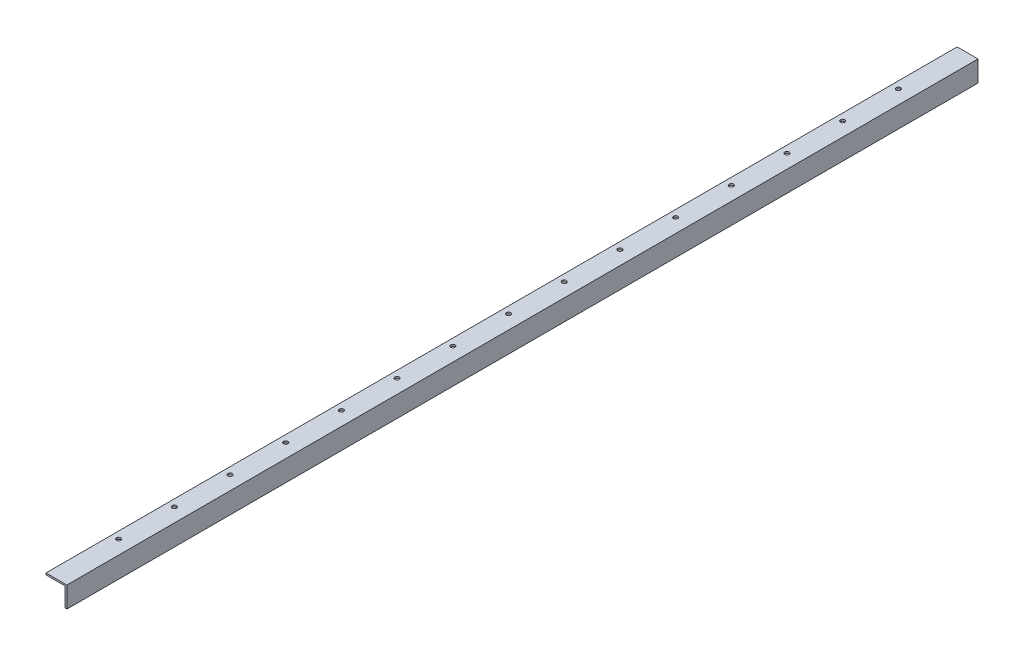
ISO-10303-21;
HEADER;
FILE_DESCRIPTION(('STEP AP214'),'2;1');
FILE_NAME('part.step','',(''),(''),'','','');
FILE_SCHEMA(('AUTOMOTIVE_DESIGN { 1 0 10303 214 1 1 1 1 }'));
ENDSEC;
DATA;
#1=APPLICATION_CONTEXT('core data for automotive mechanical design processes');
#2=APPLICATION_PROTOCOL_DEFINITION('international standard','automotive_design',2000,#1);
#3=PRODUCT_CONTEXT('',#1,'mechanical');
#4=PRODUCT('Part','Part','',(#3));
#5=PRODUCT_RELATED_PRODUCT_CATEGORY('part','',(#4));
#6=PRODUCT_DEFINITION_FORMATION('','',#4);
#7=PRODUCT_DEFINITION_CONTEXT('part definition',#1,'design');
#8=PRODUCT_DEFINITION('design','',#6,#7);
#9=PRODUCT_DEFINITION_SHAPE('','',#8);
#10=(LENGTH_UNIT() NAMED_UNIT(*) SI_UNIT(.MILLI.,.METRE.));
#11=(NAMED_UNIT(*) PLANE_ANGLE_UNIT() SI_UNIT($,.RADIAN.));
#12=(NAMED_UNIT(*) SI_UNIT($,.STERADIAN.) SOLID_ANGLE_UNIT());
#13=UNCERTAINTY_MEASURE_WITH_UNIT(LENGTH_MEASURE(1.E-05),#10,'distance_accuracy_value','');
#14=(GEOMETRIC_REPRESENTATION_CONTEXT(3) GLOBAL_UNCERTAINTY_ASSIGNED_CONTEXT((#13)) GLOBAL_UNIT_ASSIGNED_CONTEXT((#10,
#11,#12)) REPRESENTATION_CONTEXT('',''));
#15=CARTESIAN_POINT('',(0.,0.,0.));
#16=DIRECTION('',(0.,0.,1.));
#17=DIRECTION('',(1.,0.,0.));
#18=AXIS2_PLACEMENT_3D('',#15,#16,#17);
#19=CARTESIAN_POINT('',(-25.4,-41.275,1542.25625));
#20=DIRECTION('',(0.,1.,0.));
#21=DIRECTION('',(0.,0.,1.));
#22=AXIS2_PLACEMENT_3D('',#19,#20,#21);
#23=CYLINDRICAL_SURFACE('',#22,3.96874999999999);
#24=CARTESIAN_POINT('',(-25.4,-3.175,1542.25625));
#25=DIRECTION('',(0.,1.,0.));
#26=DIRECTION('',(0.,0.,1.));
#27=AXIS2_PLACEMENT_3D('',#24,#25,#26);
#28=CIRCLE('',#27,3.96874999999999);
#29=CARTESIAN_POINT('',(-25.4,-3.175,1546.225));
#30=VERTEX_POINT('',#29);
#31=EDGE_CURVE('E45',#30,#30,#28,.T.);
#32=ORIENTED_EDGE('',*,*,#31,.F.);
#33=EDGE_LOOP('',(#32));
#34=FACE_BOUND('',#33,.T.);
#35=CARTESIAN_POINT('',(-25.4,0.,1542.25625));
#36=DIRECTION('',(0.,-1.,0.));
#37=DIRECTION('',(1.,0.,0.));
#38=AXIS2_PLACEMENT_3D('',#35,#36,#37);
#39=CIRCLE('',#38,3.96874999999999);
#40=CARTESIAN_POINT('',(-21.43125,0.,1542.25625));
#41=VERTEX_POINT('',#40);
#42=EDGE_CURVE('E11',#41,#41,#39,.T.);
#43=ORIENTED_EDGE('',*,*,#42,.F.);
#44=EDGE_LOOP('',(#43));
#45=FACE_BOUND('',#44,.T.);
#46=ADVANCED_FACE('F37',(#34,#45),#23,.F.);
#47=CARTESIAN_POINT('',(-25.4,-41.275,1440.65625));
#48=DIRECTION('',(0.,1.,0.));
#49=DIRECTION('',(0.,0.,1.));
#50=AXIS2_PLACEMENT_3D('',#47,#48,#49);
#51=CYLINDRICAL_SURFACE('',#50,3.96874999999999);
#52=CARTESIAN_POINT('',(-25.4,-3.175,1440.65625));
#53=DIRECTION('',(0.,1.,0.));
#54=DIRECTION('',(0.,0.,1.));
#55=AXIS2_PLACEMENT_3D('',#52,#53,#54);
#56=CIRCLE('',#55,3.96874999999999);
#57=CARTESIAN_POINT('',(-25.4,-3.175,1444.625));
#58=VERTEX_POINT('',#57);
#59=EDGE_CURVE('E213',#58,#58,#56,.T.);
#60=ORIENTED_EDGE('',*,*,#59,.F.);
#61=EDGE_LOOP('',(#60));
#62=FACE_BOUND('',#61,.T.);
#63=CARTESIAN_POINT('',(-25.4,0.,1440.65625));
#64=DIRECTION('',(0.,-1.,0.));
#65=DIRECTION('',(1.,0.,0.));
#66=AXIS2_PLACEMENT_3D('',#63,#64,#65);
#67=CIRCLE('',#66,3.96874999999999);
#68=CARTESIAN_POINT('',(-21.43125,0.,1440.65625));
#69=VERTEX_POINT('',#68);
#70=EDGE_CURVE('E216',#69,#69,#67,.T.);
#71=ORIENTED_EDGE('',*,*,#70,.F.);
#72=EDGE_LOOP('',(#71));
#73=FACE_BOUND('',#72,.T.);
#74=ADVANCED_FACE('F224',(#62,#73),#51,.F.);
#75=CARTESIAN_POINT('',(-25.4,-41.275,1339.05625));
#76=DIRECTION('',(0.,1.,0.));
#77=DIRECTION('',(0.,0.,1.));
#78=AXIS2_PLACEMENT_3D('',#75,#76,#77);
#79=CYLINDRICAL_SURFACE('',#78,3.96874999999999);
#80=CARTESIAN_POINT('',(-25.4,-3.175,1339.05625));
#81=DIRECTION('',(0.,1.,0.));
#82=DIRECTION('',(0.,0.,1.));
#83=AXIS2_PLACEMENT_3D('',#80,#81,#82);
#84=CIRCLE('',#83,3.96874999999999);
#85=CARTESIAN_POINT('',(-25.4,-3.175,1343.025));
#86=VERTEX_POINT('',#85);
#87=EDGE_CURVE('E207',#86,#86,#84,.T.);
#88=ORIENTED_EDGE('',*,*,#87,.F.);
#89=EDGE_LOOP('',(#88));
#90=FACE_BOUND('',#89,.T.);
#91=CARTESIAN_POINT('',(-25.4,0.,1339.05625));
#92=DIRECTION('',(0.,-1.,0.));
#93=DIRECTION('',(1.,0.,0.));
#94=AXIS2_PLACEMENT_3D('',#91,#92,#93);
#95=CIRCLE('',#94,3.96874999999999);
#96=CARTESIAN_POINT('',(-21.43125,0.,1339.05625));
#97=VERTEX_POINT('',#96);
#98=EDGE_CURVE('E210',#97,#97,#95,.T.);
#99=ORIENTED_EDGE('',*,*,#98,.F.);
#100=EDGE_LOOP('',(#99));
#101=FACE_BOUND('',#100,.T.);
#102=ADVANCED_FACE('F285',(#90,#101),#79,.F.);
#103=CARTESIAN_POINT('',(-25.4,-41.275,1237.45625));
#104=DIRECTION('',(0.,1.,0.));
#105=DIRECTION('',(0.,0.,1.));
#106=AXIS2_PLACEMENT_3D('',#103,#104,#105);
#107=CYLINDRICAL_SURFACE('',#106,3.96874999999999);
#108=CARTESIAN_POINT('',(-25.4,-3.175,1237.45625));
#109=DIRECTION('',(0.,1.,0.));
#110=DIRECTION('',(0.,0.,1.));
#111=AXIS2_PLACEMENT_3D('',#108,#109,#110);
#112=CIRCLE('',#111,3.96874999999999);
#113=CARTESIAN_POINT('',(-25.4,-3.175,1241.425));
#114=VERTEX_POINT('',#113);
#115=EDGE_CURVE('E201',#114,#114,#112,.T.);
#116=ORIENTED_EDGE('',*,*,#115,.F.);
#117=EDGE_LOOP('',(#116));
#118=FACE_BOUND('',#117,.T.);
#119=CARTESIAN_POINT('',(-25.4,0.,1237.45625));
#120=DIRECTION('',(0.,-1.,0.));
#121=DIRECTION('',(1.,0.,0.));
#122=AXIS2_PLACEMENT_3D('',#119,#120,#121);
#123=CIRCLE('',#122,3.96874999999999);
#124=CARTESIAN_POINT('',(-21.43125,0.,1237.45625));
#125=VERTEX_POINT('',#124);
#126=EDGE_CURVE('E204',#125,#125,#123,.T.);
#127=ORIENTED_EDGE('',*,*,#126,.F.);
#128=EDGE_LOOP('',(#127));
#129=FACE_BOUND('',#128,.T.);
#130=ADVANCED_FACE('F281',(#118,#129),#107,.F.);
#131=CARTESIAN_POINT('',(-25.4,-41.275,1135.85625));
#132=DIRECTION('',(0.,1.,0.));
#133=DIRECTION('',(0.,0.,1.));
#134=AXIS2_PLACEMENT_3D('',#131,#132,#133);
#135=CYLINDRICAL_SURFACE('',#134,3.96874999999999);
#136=CARTESIAN_POINT('',(-25.4,-3.175,1135.85625));
#137=DIRECTION('',(0.,1.,0.));
#138=DIRECTION('',(0.,0.,1.));
#139=AXIS2_PLACEMENT_3D('',#136,#137,#138);
#140=CIRCLE('',#139,3.96874999999999);
#141=CARTESIAN_POINT('',(-25.4,-3.175,1139.825));
#142=VERTEX_POINT('',#141);
#143=EDGE_CURVE('E195',#142,#142,#140,.T.);
#144=ORIENTED_EDGE('',*,*,#143,.F.);
#145=EDGE_LOOP('',(#144));
#146=FACE_BOUND('',#145,.T.);
#147=CARTESIAN_POINT('',(-25.4,0.,1135.85625));
#148=DIRECTION('',(0.,-1.,0.));
#149=DIRECTION('',(1.,0.,0.));
#150=AXIS2_PLACEMENT_3D('',#147,#148,#149);
#151=CIRCLE('',#150,3.96874999999999);
#152=CARTESIAN_POINT('',(-21.43125,0.,1135.85625));
#153=VERTEX_POINT('',#152);
#154=EDGE_CURVE('E198',#153,#153,#151,.T.);
#155=ORIENTED_EDGE('',*,*,#154,.F.);
#156=EDGE_LOOP('',(#155));
#157=FACE_BOUND('',#156,.T.);
#158=ADVANCED_FACE('F277',(#146,#157),#135,.F.);
#159=CARTESIAN_POINT('',(-25.4,-41.275,1034.25625));
#160=DIRECTION('',(0.,1.,0.));
#161=DIRECTION('',(0.,0.,1.));
#162=AXIS2_PLACEMENT_3D('',#159,#160,#161);
#163=CYLINDRICAL_SURFACE('',#162,3.96874999999999);
#164=CARTESIAN_POINT('',(-25.4,-3.175,1034.25625));
#165=DIRECTION('',(0.,1.,0.));
#166=DIRECTION('',(0.,0.,1.));
#167=AXIS2_PLACEMENT_3D('',#164,#165,#166);
#168=CIRCLE('',#167,3.96874999999999);
#169=CARTESIAN_POINT('',(-25.4,-3.175,1038.225));
#170=VERTEX_POINT('',#169);
#171=EDGE_CURVE('E189',#170,#170,#168,.T.);
#172=ORIENTED_EDGE('',*,*,#171,.F.);
#173=EDGE_LOOP('',(#172));
#174=FACE_BOUND('',#173,.T.);
#175=CARTESIAN_POINT('',(-25.4,0.,1034.25625));
#176=DIRECTION('',(0.,-1.,0.));
#177=DIRECTION('',(1.,0.,0.));
#178=AXIS2_PLACEMENT_3D('',#175,#176,#177);
#179=CIRCLE('',#178,3.96874999999999);
#180=CARTESIAN_POINT('',(-21.43125,0.,1034.25625));
#181=VERTEX_POINT('',#180);
#182=EDGE_CURVE('E192',#181,#181,#179,.T.);
#183=ORIENTED_EDGE('',*,*,#182,.F.);
#184=EDGE_LOOP('',(#183));
#185=FACE_BOUND('',#184,.T.);
#186=ADVANCED_FACE('F273',(#174,#185),#163,.F.);
#187=CARTESIAN_POINT('',(-25.4,-41.275,932.65625));
#188=DIRECTION('',(0.,1.,0.));
#189=DIRECTION('',(0.,0.,1.));
#190=AXIS2_PLACEMENT_3D('',#187,#188,#189);
#191=CYLINDRICAL_SURFACE('',#190,3.96874999999999);
#192=CARTESIAN_POINT('',(-25.4,-3.175,932.65625));
#193=DIRECTION('',(0.,1.,0.));
#194=DIRECTION('',(0.,0.,1.));
#195=AXIS2_PLACEMENT_3D('',#192,#193,#194);
#196=CIRCLE('',#195,3.96874999999999);
#197=CARTESIAN_POINT('',(-25.4,-3.175,936.625));
#198=VERTEX_POINT('',#197);
#199=EDGE_CURVE('E183',#198,#198,#196,.T.);
#200=ORIENTED_EDGE('',*,*,#199,.F.);
#201=EDGE_LOOP('',(#200));
#202=FACE_BOUND('',#201,.T.);
#203=CARTESIAN_POINT('',(-25.4,0.,932.65625));
#204=DIRECTION('',(0.,-1.,0.));
#205=DIRECTION('',(1.,0.,0.));
#206=AXIS2_PLACEMENT_3D('',#203,#204,#205);
#207=CIRCLE('',#206,3.96874999999999);
#208=CARTESIAN_POINT('',(-21.43125,0.,932.65625));
#209=VERTEX_POINT('',#208);
#210=EDGE_CURVE('E186',#209,#209,#207,.T.);
#211=ORIENTED_EDGE('',*,*,#210,.F.);
#212=EDGE_LOOP('',(#211));
#213=FACE_BOUND('',#212,.T.);
#214=ADVANCED_FACE('F269',(#202,#213),#191,.F.);
#215=CARTESIAN_POINT('',(-25.4,-41.275,831.05625));
#216=DIRECTION('',(0.,1.,0.));
#217=DIRECTION('',(0.,0.,1.));
#218=AXIS2_PLACEMENT_3D('',#215,#216,#217);
#219=CYLINDRICAL_SURFACE('',#218,3.96874999999999);
#220=CARTESIAN_POINT('',(-25.4,-3.175,831.05625));
#221=DIRECTION('',(0.,1.,0.));
#222=DIRECTION('',(0.,0.,1.));
#223=AXIS2_PLACEMENT_3D('',#220,#221,#222);
#224=CIRCLE('',#223,3.96874999999999);
#225=CARTESIAN_POINT('',(-25.4,-3.175,835.025));
#226=VERTEX_POINT('',#225);
#227=EDGE_CURVE('E177',#226,#226,#224,.T.);
#228=ORIENTED_EDGE('',*,*,#227,.F.);
#229=EDGE_LOOP('',(#228));
#230=FACE_BOUND('',#229,.T.);
#231=CARTESIAN_POINT('',(-25.4,0.,831.05625));
#232=DIRECTION('',(0.,-1.,0.));
#233=DIRECTION('',(1.,0.,0.));
#234=AXIS2_PLACEMENT_3D('',#231,#232,#233);
#235=CIRCLE('',#234,3.96874999999999);
#236=CARTESIAN_POINT('',(-21.43125,0.,831.05625));
#237=VERTEX_POINT('',#236);
#238=EDGE_CURVE('E180',#237,#237,#235,.T.);
#239=ORIENTED_EDGE('',*,*,#238,.F.);
#240=EDGE_LOOP('',(#239));
#241=FACE_BOUND('',#240,.T.);
#242=ADVANCED_FACE('F265',(#230,#241),#219,.F.);
#243=CARTESIAN_POINT('',(-25.4,-41.275,729.45625));
#244=DIRECTION('',(0.,1.,0.));
#245=DIRECTION('',(0.,0.,1.));
#246=AXIS2_PLACEMENT_3D('',#243,#244,#245);
#247=CYLINDRICAL_SURFACE('',#246,3.96874999999999);
#248=CARTESIAN_POINT('',(-25.4,-3.175,729.45625));
#249=DIRECTION('',(0.,1.,0.));
#250=DIRECTION('',(0.,0.,1.));
#251=AXIS2_PLACEMENT_3D('',#248,#249,#250);
#252=CIRCLE('',#251,3.96874999999999);
#253=CARTESIAN_POINT('',(-25.4,-3.175,733.425));
#254=VERTEX_POINT('',#253);
#255=EDGE_CURVE('E171',#254,#254,#252,.T.);
#256=ORIENTED_EDGE('',*,*,#255,.F.);
#257=EDGE_LOOP('',(#256));
#258=FACE_BOUND('',#257,.T.);
#259=CARTESIAN_POINT('',(-25.4,0.,729.45625));
#260=DIRECTION('',(0.,-1.,0.));
#261=DIRECTION('',(1.,0.,0.));
#262=AXIS2_PLACEMENT_3D('',#259,#260,#261);
#263=CIRCLE('',#262,3.96874999999999);
#264=CARTESIAN_POINT('',(-21.43125,0.,729.45625));
#265=VERTEX_POINT('',#264);
#266=EDGE_CURVE('E174',#265,#265,#263,.T.);
#267=ORIENTED_EDGE('',*,*,#266,.F.);
#268=EDGE_LOOP('',(#267));
#269=FACE_BOUND('',#268,.T.);
#270=ADVANCED_FACE('F261',(#258,#269),#247,.F.);
#271=CARTESIAN_POINT('',(-25.4,-41.275,627.85625));
#272=DIRECTION('',(0.,1.,0.));
#273=DIRECTION('',(0.,0.,1.));
#274=AXIS2_PLACEMENT_3D('',#271,#272,#273);
#275=CYLINDRICAL_SURFACE('',#274,3.96874999999999);
#276=CARTESIAN_POINT('',(-25.4,-3.175,627.85625));
#277=DIRECTION('',(0.,1.,0.));
#278=DIRECTION('',(0.,0.,1.));
#279=AXIS2_PLACEMENT_3D('',#276,#277,#278);
#280=CIRCLE('',#279,3.96874999999999);
#281=CARTESIAN_POINT('',(-25.4,-3.175,631.825));
#282=VERTEX_POINT('',#281);
#283=EDGE_CURVE('E165',#282,#282,#280,.T.);
#284=ORIENTED_EDGE('',*,*,#283,.F.);
#285=EDGE_LOOP('',(#284));
#286=FACE_BOUND('',#285,.T.);
#287=CARTESIAN_POINT('',(-25.4,0.,627.85625));
#288=DIRECTION('',(0.,-1.,0.));
#289=DIRECTION('',(1.,0.,0.));
#290=AXIS2_PLACEMENT_3D('',#287,#288,#289);
#291=CIRCLE('',#290,3.96874999999999);
#292=CARTESIAN_POINT('',(-21.43125,0.,627.85625));
#293=VERTEX_POINT('',#292);
#294=EDGE_CURVE('E168',#293,#293,#291,.T.);
#295=ORIENTED_EDGE('',*,*,#294,.F.);
#296=EDGE_LOOP('',(#295));
#297=FACE_BOUND('',#296,.T.);
#298=ADVANCED_FACE('F257',(#286,#297),#275,.F.);
#299=CARTESIAN_POINT('',(-25.4,-41.275,526.25625));
#300=DIRECTION('',(0.,1.,0.));
#301=DIRECTION('',(0.,0.,1.));
#302=AXIS2_PLACEMENT_3D('',#299,#300,#301);
#303=CYLINDRICAL_SURFACE('',#302,3.96874999999999);
#304=CARTESIAN_POINT('',(-25.4,-3.175,526.25625));
#305=DIRECTION('',(0.,1.,0.));
#306=DIRECTION('',(0.,0.,1.));
#307=AXIS2_PLACEMENT_3D('',#304,#305,#306);
#308=CIRCLE('',#307,3.96874999999999);
#309=CARTESIAN_POINT('',(-25.4,-3.175,530.225));
#310=VERTEX_POINT('',#309);
#311=EDGE_CURVE('E159',#310,#310,#308,.T.);
#312=ORIENTED_EDGE('',*,*,#311,.F.);
#313=EDGE_LOOP('',(#312));
#314=FACE_BOUND('',#313,.T.);
#315=CARTESIAN_POINT('',(-25.4,0.,526.25625));
#316=DIRECTION('',(0.,-1.,0.));
#317=DIRECTION('',(1.,0.,0.));
#318=AXIS2_PLACEMENT_3D('',#315,#316,#317);
#319=CIRCLE('',#318,3.96874999999999);
#320=CARTESIAN_POINT('',(-21.43125,0.,526.25625));
#321=VERTEX_POINT('',#320);
#322=EDGE_CURVE('E162',#321,#321,#319,.T.);
#323=ORIENTED_EDGE('',*,*,#322,.F.);
#324=EDGE_LOOP('',(#323));
#325=FACE_BOUND('',#324,.T.);
#326=ADVANCED_FACE('F253',(#314,#325),#303,.F.);
#327=CARTESIAN_POINT('',(-25.4,-41.275,424.65625));
#328=DIRECTION('',(0.,1.,0.));
#329=DIRECTION('',(0.,0.,1.));
#330=AXIS2_PLACEMENT_3D('',#327,#328,#329);
#331=CYLINDRICAL_SURFACE('',#330,3.96874999999999);
#332=CARTESIAN_POINT('',(-25.4,-3.175,424.65625));
#333=DIRECTION('',(0.,1.,0.));
#334=DIRECTION('',(0.,0.,1.));
#335=AXIS2_PLACEMENT_3D('',#332,#333,#334);
#336=CIRCLE('',#335,3.96874999999999);
#337=CARTESIAN_POINT('',(-25.4,-3.175,428.625));
#338=VERTEX_POINT('',#337);
#339=EDGE_CURVE('E153',#338,#338,#336,.T.);
#340=ORIENTED_EDGE('',*,*,#339,.F.);
#341=EDGE_LOOP('',(#340));
#342=FACE_BOUND('',#341,.T.);
#343=CARTESIAN_POINT('',(-25.4,0.,424.65625));
#344=DIRECTION('',(0.,-1.,0.));
#345=DIRECTION('',(1.,0.,0.));
#346=AXIS2_PLACEMENT_3D('',#343,#344,#345);
#347=CIRCLE('',#346,3.96874999999999);
#348=CARTESIAN_POINT('',(-21.43125,0.,424.65625));
#349=VERTEX_POINT('',#348);
#350=EDGE_CURVE('E156',#349,#349,#347,.T.);
#351=ORIENTED_EDGE('',*,*,#350,.F.);
#352=EDGE_LOOP('',(#351));
#353=FACE_BOUND('',#352,.T.);
#354=ADVANCED_FACE('F249',(#342,#353),#331,.F.);
#355=CARTESIAN_POINT('',(-25.4,-41.275,323.05625));
#356=DIRECTION('',(0.,1.,0.));
#357=DIRECTION('',(0.,0.,1.));
#358=AXIS2_PLACEMENT_3D('',#355,#356,#357);
#359=CYLINDRICAL_SURFACE('',#358,3.96874999999999);
#360=CARTESIAN_POINT('',(-25.4,-3.175,323.05625));
#361=DIRECTION('',(0.,1.,0.));
#362=DIRECTION('',(0.,0.,1.));
#363=AXIS2_PLACEMENT_3D('',#360,#361,#362);
#364=CIRCLE('',#363,3.96874999999999);
#365=CARTESIAN_POINT('',(-25.4,-3.175,327.025));
#366=VERTEX_POINT('',#365);
#367=EDGE_CURVE('E143',#366,#366,#364,.T.);
#368=ORIENTED_EDGE('',*,*,#367,.F.);
#369=EDGE_LOOP('',(#368));
#370=FACE_BOUND('',#369,.T.);
#371=CARTESIAN_POINT('',(-25.4,0.,323.05625));
#372=DIRECTION('',(0.,-1.,0.));
#373=DIRECTION('',(1.,0.,0.));
#374=AXIS2_PLACEMENT_3D('',#371,#372,#373);
#375=CIRCLE('',#374,3.96874999999999);
#376=CARTESIAN_POINT('',(-21.43125,0.,323.05625));
#377=VERTEX_POINT('',#376);
#378=EDGE_CURVE('E150',#377,#377,#375,.T.);
#379=ORIENTED_EDGE('',*,*,#378,.F.);
#380=EDGE_LOOP('',(#379));
#381=FACE_BOUND('',#380,.T.);
#382=ADVANCED_FACE('F241',(#370,#381),#359,.F.);
#383=CARTESIAN_POINT('',(0.,-38.1,1662.1125));
#384=DIRECTION('',(-1.,0.,0.));
#385=DIRECTION('',(0.,0.,1.));
#386=AXIS2_PLACEMENT_3D('',#383,#384,#385);
#387=PLANE('',#386);
#388=DIRECTION('',(0.,1.,0.));
#389=VECTOR('',#388,1.);
#390=CARTESIAN_POINT('',(0.,-38.1,0.));
#391=LINE('',#390,#389);
#392=CARTESIAN_POINT('',(0.,-38.1,0.));
#393=VERTEX_POINT('',#392);
#394=CARTESIAN_POINT('',(0.,0.,0.));
#395=VERTEX_POINT('',#394);
#396=EDGE_CURVE('E123',#393,#395,#391,.T.);
#397=ORIENTED_EDGE('',*,*,#396,.T.);
#398=DIRECTION('',(0.,0.,-1.));
#399=VECTOR('',#398,1.);
#400=CARTESIAN_POINT('',(0.,0.,1662.1125));
#401=LINE('',#400,#399);
#402=CARTESIAN_POINT('',(0.,0.,1662.1125));
#403=VERTEX_POINT('',#402);
#404=EDGE_CURVE('E141',#403,#395,#401,.T.);
#405=ORIENTED_EDGE('',*,*,#404,.F.);
#406=DIRECTION('',(0.,1.,0.));
#407=VECTOR('',#406,1.);
#408=CARTESIAN_POINT('',(0.,-38.1,1662.1125));
#409=LINE('',#408,#407);
#410=CARTESIAN_POINT('',(0.,-38.1,1662.1125));
#411=VERTEX_POINT('',#410);
#412=EDGE_CURVE('E134',#411,#403,#409,.T.);
#413=ORIENTED_EDGE('',*,*,#412,.F.);
#414=DIRECTION('',(0.,0.,-1.));
#415=VECTOR('',#414,1.);
#416=CARTESIAN_POINT('',(0.,-38.1,1662.1125));
#417=LINE('',#416,#415);
#418=EDGE_CURVE('E119',#411,#393,#417,.T.);
#419=ORIENTED_EDGE('',*,*,#418,.T.);
#420=EDGE_LOOP('',(#397,#405,#413,#419));
#421=FACE_BOUND('',#420,.T.);
#422=ADVANCED_FACE('F230',(#421),#387,.F.);
#423=CARTESIAN_POINT('',(0.,0.,1662.1125));
#424=DIRECTION('',(0.,-1.,0.));
#425=DIRECTION('',(1.,0.,0.));
#426=AXIS2_PLACEMENT_3D('',#423,#424,#425);
#427=PLANE('',#426);
#428=CARTESIAN_POINT('',(-25.4,0.,221.45625));
#429=DIRECTION('',(0.,-1.,0.));
#430=DIRECTION('',(1.,0.,0.));
#431=AXIS2_PLACEMENT_3D('',#428,#429,#430);
#432=CIRCLE('',#431,3.96874999999999);
#433=CARTESIAN_POINT('',(-21.43125,0.,221.45625));
#434=VERTEX_POINT('',#433);
#435=EDGE_CURVE('E147',#434,#434,#432,.T.);
#436=ORIENTED_EDGE('',*,*,#435,.T.);
#437=EDGE_LOOP('',(#436));
#438=FACE_BOUND('',#437,.T.);
#439=CARTESIAN_POINT('',(-25.4,0.,119.85625));
#440=DIRECTION('',(0.,-1.,0.));
#441=DIRECTION('',(1.,0.,0.));
#442=AXIS2_PLACEMENT_3D('',#439,#440,#441);
#443=CIRCLE('',#442,3.96874999999999);
#444=CARTESIAN_POINT('',(-21.43125,0.,119.85625));
#445=VERTEX_POINT('',#444);
#446=EDGE_CURVE('E127',#445,#445,#443,.T.);
#447=ORIENTED_EDGE('',*,*,#446,.T.);
#448=EDGE_LOOP('',(#447));
#449=FACE_BOUND('',#448,.T.);
#450=DIRECTION('',(-1.,0.,0.));
#451=VECTOR('',#450,1.);
#452=CARTESIAN_POINT('',(0.,0.,0.));
#453=LINE('',#452,#451);
#454=CARTESIAN_POINT('',(-38.1,0.,0.));
#455=VERTEX_POINT('',#454);
#456=EDGE_CURVE('E126',#395,#455,#453,.T.);
#457=ORIENTED_EDGE('',*,*,#456,.T.);
#458=DIRECTION('',(0.,0.,-1.));
#459=VECTOR('',#458,1.);
#460=CARTESIAN_POINT('',(-38.1,0.,1662.1125));
#461=LINE('',#460,#459);
#462=CARTESIAN_POINT('',(-38.1,0.,1662.1125));
#463=VERTEX_POINT('',#462);
#464=EDGE_CURVE('E138',#463,#455,#461,.T.);
#465=ORIENTED_EDGE('',*,*,#464,.F.);
#466=DIRECTION('',(-1.,0.,0.));
#467=VECTOR('',#466,1.);
#468=CARTESIAN_POINT('',(0.,0.,1662.1125));
#469=LINE('',#468,#467);
#470=EDGE_CURVE('E91',#403,#463,#469,.T.);
#471=ORIENTED_EDGE('',*,*,#470,.F.);
#472=ORIENTED_EDGE('',*,*,#404,.T.);
#473=EDGE_LOOP('',(#457,#465,#471,#472));
#474=FACE_BOUND('',#473,.T.);
#475=ORIENTED_EDGE('',*,*,#378,.T.);
#476=EDGE_LOOP('',(#475));
#477=FACE_BOUND('',#476,.T.);
#478=ORIENTED_EDGE('',*,*,#350,.T.);
#479=EDGE_LOOP('',(#478));
#480=FACE_BOUND('',#479,.T.);
#481=ORIENTED_EDGE('',*,*,#322,.T.);
#482=EDGE_LOOP('',(#481));
#483=FACE_BOUND('',#482,.T.);
#484=ORIENTED_EDGE('',*,*,#294,.T.);
#485=EDGE_LOOP('',(#484));
#486=FACE_BOUND('',#485,.T.);
#487=ORIENTED_EDGE('',*,*,#266,.T.);
#488=EDGE_LOOP('',(#487));
#489=FACE_BOUND('',#488,.T.);
#490=ORIENTED_EDGE('',*,*,#238,.T.);
#491=EDGE_LOOP('',(#490));
#492=FACE_BOUND('',#491,.T.);
#493=ORIENTED_EDGE('',*,*,#210,.T.);
#494=EDGE_LOOP('',(#493));
#495=FACE_BOUND('',#494,.T.);
#496=ORIENTED_EDGE('',*,*,#182,.T.);
#497=EDGE_LOOP('',(#496));
#498=FACE_BOUND('',#497,.T.);
#499=ORIENTED_EDGE('',*,*,#154,.T.);
#500=EDGE_LOOP('',(#499));
#501=FACE_BOUND('',#500,.T.);
#502=ORIENTED_EDGE('',*,*,#126,.T.);
#503=EDGE_LOOP('',(#502));
#504=FACE_BOUND('',#503,.T.);
#505=ORIENTED_EDGE('',*,*,#98,.T.);
#506=EDGE_LOOP('',(#505));
#507=FACE_BOUND('',#506,.T.);
#508=ORIENTED_EDGE('',*,*,#70,.T.);
#509=EDGE_LOOP('',(#508));
#510=FACE_BOUND('',#509,.T.);
#511=ORIENTED_EDGE('',*,*,#42,.T.);
#512=EDGE_LOOP('',(#511));
#513=FACE_BOUND('',#512,.T.);
#514=ADVANCED_FACE('F227',(#438,#449,#474,#477,#480,#483,#486,#489,#492,#495,#498,#501,#504,
#507,#510,#513),#427,.F.);
#515=CARTESIAN_POINT('',(-38.1,0.,1662.1125));
#516=DIRECTION('',(1.,0.,0.));
#517=DIRECTION('',(0.,0.,-1.));
#518=AXIS2_PLACEMENT_3D('',#515,#516,#517);
#519=PLANE('',#518);
#520=DIRECTION('',(0.,-1.,0.));
#521=VECTOR('',#520,1.);
#522=CARTESIAN_POINT('',(-38.1,0.,0.));
#523=LINE('',#522,#521);
#524=CARTESIAN_POINT('',(-38.1,-3.17500000000001,0.));
#525=VERTEX_POINT('',#524);
#526=EDGE_CURVE('E129',#455,#525,#523,.T.);
#527=ORIENTED_EDGE('',*,*,#526,.T.);
#528=DIRECTION('',(0.,0.,-1.));
#529=VECTOR('',#528,1.);
#530=CARTESIAN_POINT('',(-38.1,-3.17500000000001,1662.1125));
#531=LINE('',#530,#529);
#532=CARTESIAN_POINT('',(-38.1,-3.17500000000001,1662.1125));
#533=VERTEX_POINT('',#532);
#534=EDGE_CURVE('E114',#533,#525,#531,.T.);
#535=ORIENTED_EDGE('',*,*,#534,.F.);
#536=DIRECTION('',(0.,-1.,0.));
#537=VECTOR('',#536,1.);
#538=CARTESIAN_POINT('',(-38.1,0.,1662.1125));
#539=LINE('',#538,#537);
#540=EDGE_CURVE('E104',#463,#533,#539,.T.);
#541=ORIENTED_EDGE('',*,*,#540,.F.);
#542=ORIENTED_EDGE('',*,*,#464,.T.);
#543=EDGE_LOOP('',(#527,#535,#541,#542));
#544=FACE_BOUND('',#543,.T.);
#545=ADVANCED_FACE('F229',(#544),#519,.F.);
#546=CARTESIAN_POINT('',(-38.1,-3.17500000000001,1662.1125));
#547=DIRECTION('',(0.,1.,0.));
#548=DIRECTION('',(0.,0.,1.));
#549=AXIS2_PLACEMENT_3D('',#546,#547,#548);
#550=PLANE('',#549);
#551=CARTESIAN_POINT('',(-25.4,-3.175,221.45625));
#552=DIRECTION('',(0.,1.,0.));
#553=DIRECTION('',(0.,0.,1.));
#554=AXIS2_PLACEMENT_3D('',#551,#552,#553);
#555=CIRCLE('',#554,3.96874999999999);
#556=CARTESIAN_POINT('',(-25.4,-3.175,225.425));
#557=VERTEX_POINT('',#556);
#558=EDGE_CURVE('E326',#557,#557,#555,.T.);
#559=ORIENTED_EDGE('',*,*,#558,.T.);
#560=EDGE_LOOP('',(#559));
#561=FACE_BOUND('',#560,.T.);
#562=CARTESIAN_POINT('',(-25.4,-3.175,119.85625));
#563=DIRECTION('',(0.,1.,0.));
#564=DIRECTION('',(0.,0.,1.));
#565=AXIS2_PLACEMENT_3D('',#562,#563,#564);
#566=CIRCLE('',#565,3.96874999999999);
#567=CARTESIAN_POINT('',(-25.4,-3.175,123.825));
#568=VERTEX_POINT('',#567);
#569=EDGE_CURVE('E144',#568,#568,#566,.T.);
#570=ORIENTED_EDGE('',*,*,#569,.T.);
#571=EDGE_LOOP('',(#570));
#572=FACE_BOUND('',#571,.T.);
#573=DIRECTION('',(1.,0.,0.));
#574=VECTOR('',#573,1.);
#575=CARTESIAN_POINT('',(-38.1,-3.17500000000001,0.));
#576=LINE('',#575,#574);
#577=CARTESIAN_POINT('',(-3.17500000000001,-3.17500000000001,0.));
#578=VERTEX_POINT('',#577);
#579=EDGE_CURVE('E113',#525,#578,#576,.T.);
#580=ORIENTED_EDGE('',*,*,#579,.T.);
#581=DIRECTION('',(0.,0.,-1.));
#582=VECTOR('',#581,1.);
#583=CARTESIAN_POINT('',(-3.17500000000001,-3.17500000000001,1662.1125));
#584=LINE('',#583,#582);
#585=CARTESIAN_POINT('',(-3.17500000000001,-3.17500000000001,1662.1125));
#586=VERTEX_POINT('',#585);
#587=EDGE_CURVE('E109',#586,#578,#584,.T.);
#588=ORIENTED_EDGE('',*,*,#587,.F.);
#589=DIRECTION('',(1.,0.,0.));
#590=VECTOR('',#589,1.);
#591=CARTESIAN_POINT('',(-38.1,-3.17500000000001,1662.1125));
#592=LINE('',#591,#590);
#593=EDGE_CURVE('E98',#533,#586,#592,.T.);
#594=ORIENTED_EDGE('',*,*,#593,.F.);
#595=ORIENTED_EDGE('',*,*,#534,.T.);
#596=EDGE_LOOP('',(#580,#588,#594,#595));
#597=FACE_BOUND('',#596,.T.);
#598=ORIENTED_EDGE('',*,*,#367,.T.);
#599=EDGE_LOOP('',(#598));
#600=FACE_BOUND('',#599,.T.);
#601=ORIENTED_EDGE('',*,*,#339,.T.);
#602=EDGE_LOOP('',(#601));
#603=FACE_BOUND('',#602,.T.);
#604=ORIENTED_EDGE('',*,*,#311,.T.);
#605=EDGE_LOOP('',(#604));
#606=FACE_BOUND('',#605,.T.);
#607=ORIENTED_EDGE('',*,*,#283,.T.);
#608=EDGE_LOOP('',(#607));
#609=FACE_BOUND('',#608,.T.);
#610=ORIENTED_EDGE('',*,*,#255,.T.);
#611=EDGE_LOOP('',(#610));
#612=FACE_BOUND('',#611,.T.);
#613=ORIENTED_EDGE('',*,*,#227,.T.);
#614=EDGE_LOOP('',(#613));
#615=FACE_BOUND('',#614,.T.);
#616=ORIENTED_EDGE('',*,*,#199,.T.);
#617=EDGE_LOOP('',(#616));
#618=FACE_BOUND('',#617,.T.);
#619=ORIENTED_EDGE('',*,*,#171,.T.);
#620=EDGE_LOOP('',(#619));
#621=FACE_BOUND('',#620,.T.);
#622=ORIENTED_EDGE('',*,*,#143,.T.);
#623=EDGE_LOOP('',(#622));
#624=FACE_BOUND('',#623,.T.);
#625=ORIENTED_EDGE('',*,*,#115,.T.);
#626=EDGE_LOOP('',(#625));
#627=FACE_BOUND('',#626,.T.);
#628=ORIENTED_EDGE('',*,*,#87,.T.);
#629=EDGE_LOOP('',(#628));
#630=FACE_BOUND('',#629,.T.);
#631=ORIENTED_EDGE('',*,*,#59,.T.);
#632=EDGE_LOOP('',(#631));
#633=FACE_BOUND('',#632,.T.);
#634=ORIENTED_EDGE('',*,*,#31,.T.);
#635=EDGE_LOOP('',(#634));
#636=FACE_BOUND('',#635,.T.);
#637=ADVANCED_FACE('F110',(#561,#572,#597,#600,#603,#606,#609,#612,#615,#618,#621,#624,#627,
#630,#633,#636),#550,.F.);
#638=CARTESIAN_POINT('',(-3.17500000000001,-3.17500000000001,1662.1125));
#639=DIRECTION('',(1.,0.,0.));
#640=DIRECTION('',(0.,1.,0.));
#641=AXIS2_PLACEMENT_3D('',#638,#639,#640);
#642=PLANE('',#641);
#643=DIRECTION('',(0.,-1.,0.));
#644=VECTOR('',#643,1.);
#645=CARTESIAN_POINT('',(-3.17500000000001,-3.17500000000001,0.));
#646=LINE('',#645,#644);
#647=CARTESIAN_POINT('',(-3.175,-38.1,0.));
#648=VERTEX_POINT('',#647);
#649=EDGE_CURVE('E76',#578,#648,#646,.T.);
#650=ORIENTED_EDGE('',*,*,#649,.T.);
#651=DIRECTION('',(0.,0.,-1.));
#652=VECTOR('',#651,1.);
#653=CARTESIAN_POINT('',(-3.175,-38.1,1662.1125));
#654=LINE('',#653,#652);
#655=CARTESIAN_POINT('',(-3.175,-38.1,1662.1125));
#656=VERTEX_POINT('',#655);
#657=EDGE_CURVE('E115',#656,#648,#654,.T.);
#658=ORIENTED_EDGE('',*,*,#657,.F.);
#659=DIRECTION('',(0.,-1.,0.));
#660=VECTOR('',#659,1.);
#661=CARTESIAN_POINT('',(-3.17500000000001,-3.17500000000001,1662.1125));
#662=LINE('',#661,#660);
#663=EDGE_CURVE('E102',#586,#656,#662,.T.);
#664=ORIENTED_EDGE('',*,*,#663,.F.);
#665=ORIENTED_EDGE('',*,*,#587,.T.);
#666=EDGE_LOOP('',(#650,#658,#664,#665));
#667=FACE_BOUND('',#666,.T.);
#668=ADVANCED_FACE('F117',(#667),#642,.F.);
#669=CARTESIAN_POINT('',(-3.175,-38.1,1662.1125));
#670=DIRECTION('',(0.,1.,0.));
#671=DIRECTION('',(0.,0.,1.));
#672=AXIS2_PLACEMENT_3D('',#669,#670,#671);
#673=PLANE('',#672);
#674=DIRECTION('',(1.,0.,0.));
#675=VECTOR('',#674,1.);
#676=CARTESIAN_POINT('',(-3.175,-38.1,0.));
#677=LINE('',#676,#675);
#678=EDGE_CURVE('E82',#648,#393,#677,.T.);
#679=ORIENTED_EDGE('',*,*,#678,.T.);
#680=ORIENTED_EDGE('',*,*,#418,.F.);
#681=DIRECTION('',(1.,0.,0.));
#682=VECTOR('',#681,1.);
#683=CARTESIAN_POINT('',(-3.175,-38.1,1662.1125));
#684=LINE('',#683,#682);
#685=EDGE_CURVE('E53',#656,#411,#684,.T.);
#686=ORIENTED_EDGE('',*,*,#685,.F.);
#687=ORIENTED_EDGE('',*,*,#657,.T.);
#688=EDGE_LOOP('',(#679,#680,#686,#687));
#689=FACE_BOUND('',#688,.T.);
#690=ADVANCED_FACE('F303',(#689),#673,.F.);
#691=CARTESIAN_POINT('',(0.,0.,1662.1125));
#692=DIRECTION('',(0.,0.,1.));
#693=DIRECTION('',(1.,0.,0.));
#694=AXIS2_PLACEMENT_3D('',#691,#692,#693);
#695=PLANE('',#694);
#696=ORIENTED_EDGE('',*,*,#412,.T.);
#697=ORIENTED_EDGE('',*,*,#470,.T.);
#698=ORIENTED_EDGE('',*,*,#540,.T.);
#699=ORIENTED_EDGE('',*,*,#593,.T.);
#700=ORIENTED_EDGE('',*,*,#663,.T.);
#701=ORIENTED_EDGE('',*,*,#685,.T.);
#702=EDGE_LOOP('',(#696,#697,#698,#699,#700,#701));
#703=FACE_BOUND('',#702,.T.);
#704=ADVANCED_FACE('F100',(#703),#695,.T.);
#705=CARTESIAN_POINT('',(0.,0.,0.));
#706=DIRECTION('',(0.,0.,1.));
#707=DIRECTION('',(1.,0.,0.));
#708=AXIS2_PLACEMENT_3D('',#705,#706,#707);
#709=PLANE('',#708);
#710=ORIENTED_EDGE('',*,*,#396,.F.);
#711=ORIENTED_EDGE('',*,*,#678,.F.);
#712=ORIENTED_EDGE('',*,*,#649,.F.);
#713=ORIENTED_EDGE('',*,*,#579,.F.);
#714=ORIENTED_EDGE('',*,*,#526,.F.);
#715=ORIENTED_EDGE('',*,*,#456,.F.);
#716=EDGE_LOOP('',(#710,#711,#712,#713,#714,#715));
#717=FACE_BOUND('',#716,.T.);
#718=ADVANCED_FACE('F310',(#717),#709,.F.);
#719=CARTESIAN_POINT('',(-25.4,-41.275,119.85625));
#720=DIRECTION('',(0.,1.,0.));
#721=DIRECTION('',(0.,0.,1.));
#722=AXIS2_PLACEMENT_3D('',#719,#720,#721);
#723=CYLINDRICAL_SURFACE('',#722,3.96874999999999);
#724=ORIENTED_EDGE('',*,*,#569,.F.);
#725=EDGE_LOOP('',(#724));
#726=FACE_BOUND('',#725,.T.);
#727=ORIENTED_EDGE('',*,*,#446,.F.);
#728=EDGE_LOOP('',(#727));
#729=FACE_BOUND('',#728,.T.);
#730=ADVANCED_FACE('F313',(#726,#729),#723,.F.);
#731=CARTESIAN_POINT('',(-25.4,-41.275,221.45625));
#732=DIRECTION('',(0.,1.,0.));
#733=DIRECTION('',(0.,0.,1.));
#734=AXIS2_PLACEMENT_3D('',#731,#732,#733);
#735=CYLINDRICAL_SURFACE('',#734,3.96874999999999);
#736=ORIENTED_EDGE('',*,*,#558,.F.);
#737=EDGE_LOOP('',(#736));
#738=FACE_BOUND('',#737,.T.);
#739=ORIENTED_EDGE('',*,*,#435,.F.);
#740=EDGE_LOOP('',(#739));
#741=FACE_BOUND('',#740,.T.);
#742=ADVANCED_FACE('F319',(#738,#741),#735,.F.);
#743=CLOSED_SHELL('',(#46,#74,#102,#130,#158,#186,#214,#242,#270,#298,#326,#354,#382,#422,#514,
#545,#637,#668,#690,#704,#718,#730,#742));
#744=MANIFOLD_SOLID_BREP('B2',#743);
#745=ADVANCED_BREP_SHAPE_REPRESENTATION('',(#18,#744),#14);
#746=SHAPE_DEFINITION_REPRESENTATION(#9,#745);
ENDSEC;
END-ISO-10303-21;
